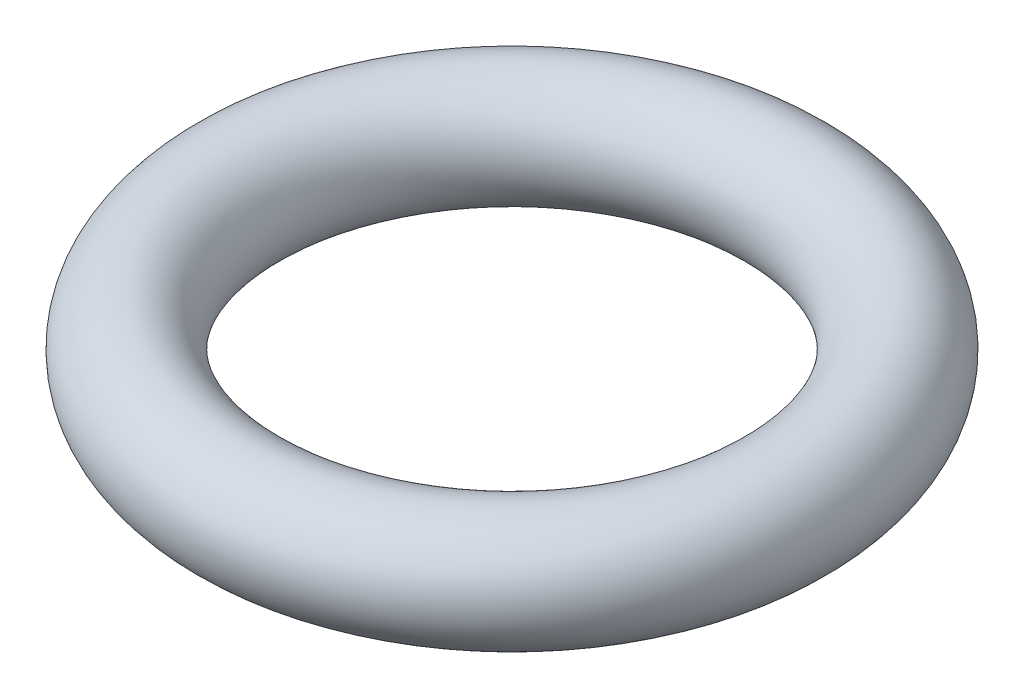
ISO-10303-21;
HEADER;
FILE_DESCRIPTION(('STEP AP214'),'2;1');
FILE_NAME('part.step','',(''),(''),'','','');
FILE_SCHEMA(('AUTOMOTIVE_DESIGN { 1 0 10303 214 1 1 1 1 }'));
ENDSEC;
DATA;
#1=APPLICATION_CONTEXT('core data for automotive mechanical design processes');
#2=APPLICATION_PROTOCOL_DEFINITION('international standard','automotive_design',2000,#1);
#3=PRODUCT_CONTEXT('',#1,'mechanical');
#4=PRODUCT('Part','Part','',(#3));
#5=PRODUCT_RELATED_PRODUCT_CATEGORY('part','',(#4));
#6=PRODUCT_DEFINITION_FORMATION('','',#4);
#7=PRODUCT_DEFINITION_CONTEXT('part definition',#1,'design');
#8=PRODUCT_DEFINITION('design','',#6,#7);
#9=PRODUCT_DEFINITION_SHAPE('','',#8);
#10=(LENGTH_UNIT() NAMED_UNIT(*) SI_UNIT(.MILLI.,.METRE.));
#11=(NAMED_UNIT(*) PLANE_ANGLE_UNIT() SI_UNIT($,.RADIAN.));
#12=(NAMED_UNIT(*) SI_UNIT($,.STERADIAN.) SOLID_ANGLE_UNIT());
#13=UNCERTAINTY_MEASURE_WITH_UNIT(LENGTH_MEASURE(1.E-05),#10,'distance_accuracy_value','');
#14=(GEOMETRIC_REPRESENTATION_CONTEXT(3) GLOBAL_UNCERTAINTY_ASSIGNED_CONTEXT((#13)) GLOBAL_UNIT_ASSIGNED_CONTEXT((#10,
#11,#12)) REPRESENTATION_CONTEXT('',''));
#15=CARTESIAN_POINT('',(0.,0.,0.));
#16=DIRECTION('',(0.,0.,1.));
#17=DIRECTION('',(1.,0.,0.));
#18=AXIS2_PLACEMENT_3D('',#15,#16,#17);
#19=CARTESIAN_POINT('',(0.,0.,0.));
#20=DIRECTION('',(0.,1.,0.));
#21=DIRECTION('',(0.,0.,1.));
#22=AXIS2_PLACEMENT_3D('',#19,#20,#21);
#23=TOROIDAL_SURFACE('',#22,12.,2.5);
#24=CARTESIAN_POINT('',(0.,0.,14.5));
#25=VERTEX_POINT('',#24);
#26=VERTEX_LOOP('',#25);
#27=FACE_BOUND('',#26,.T.);
#28=ADVANCED_FACE('F28',(#27),#23,.T.);
#29=CLOSED_SHELL('',(#28));
#30=MANIFOLD_SOLID_BREP('B2',#29);
#31=ADVANCED_BREP_SHAPE_REPRESENTATION('',(#18,#30),#14);
#32=SHAPE_DEFINITION_REPRESENTATION(#9,#31);
ENDSEC;
END-ISO-10303-21;
